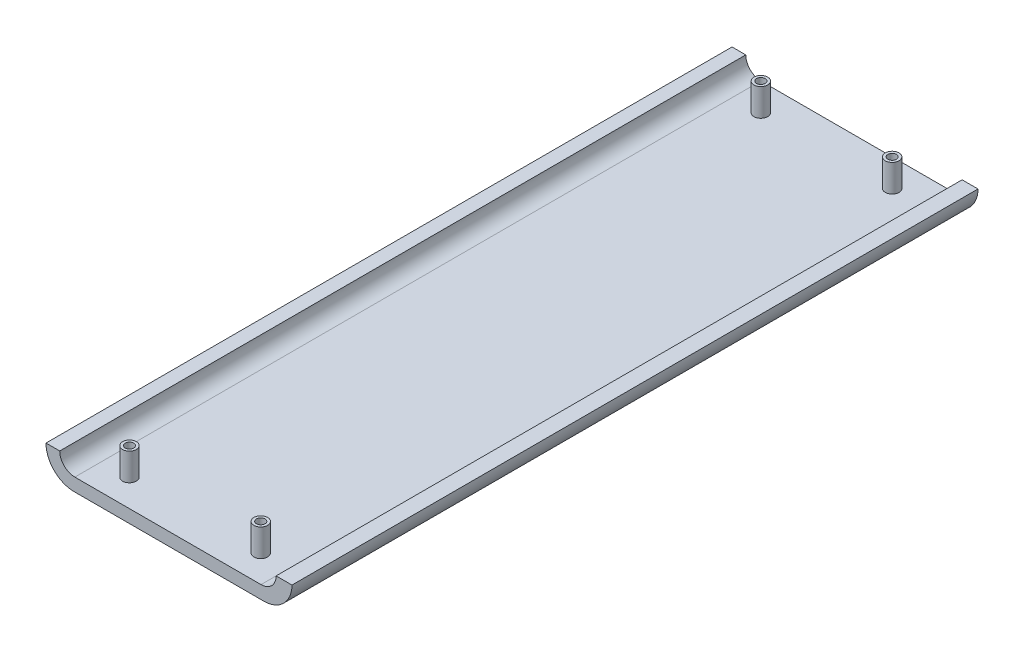
ISO-10303-21;
HEADER;
FILE_DESCRIPTION(('STEP AP214'),'2;1');
FILE_NAME('part.step','',(''),(''),'','','');
FILE_SCHEMA(('AUTOMOTIVE_DESIGN { 1 0 10303 214 1 1 1 1 }'));
ENDSEC;
DATA;
#1=APPLICATION_CONTEXT('core data for automotive mechanical design processes');
#2=APPLICATION_PROTOCOL_DEFINITION('international standard','automotive_design',2000,#1);
#3=PRODUCT_CONTEXT('',#1,'mechanical');
#4=PRODUCT('Part','Part','',(#3));
#5=PRODUCT_RELATED_PRODUCT_CATEGORY('part','',(#4));
#6=PRODUCT_DEFINITION_FORMATION('','',#4);
#7=PRODUCT_DEFINITION_CONTEXT('part definition',#1,'design');
#8=PRODUCT_DEFINITION('design','',#6,#7);
#9=PRODUCT_DEFINITION_SHAPE('','',#8);
#10=(LENGTH_UNIT() NAMED_UNIT(*) SI_UNIT(.MILLI.,.METRE.));
#11=(NAMED_UNIT(*) PLANE_ANGLE_UNIT() SI_UNIT($,.RADIAN.));
#12=(NAMED_UNIT(*) SI_UNIT($,.STERADIAN.) SOLID_ANGLE_UNIT());
#13=UNCERTAINTY_MEASURE_WITH_UNIT(LENGTH_MEASURE(1.E-05),#10,'distance_accuracy_value','');
#14=(GEOMETRIC_REPRESENTATION_CONTEXT(3) GLOBAL_UNCERTAINTY_ASSIGNED_CONTEXT((#13)) GLOBAL_UNIT_ASSIGNED_CONTEXT((#10,
#11,#12)) REPRESENTATION_CONTEXT('',''));
#15=CARTESIAN_POINT('',(0.,0.,0.));
#16=DIRECTION('',(0.,0.,1.));
#17=DIRECTION('',(1.,0.,0.));
#18=AXIS2_PLACEMENT_3D('',#15,#16,#17);
#19=CARTESIAN_POINT('',(-33.1310446929488,5.19258967374228,127.));
#20=DIRECTION('',(0.,0.,-1.));
#21=DIRECTION('',(-1.,0.,0.));
#22=AXIS2_PLACEMENT_3D('',#19,#20,#21);
#23=CYLINDRICAL_SURFACE('',#22,5.19258967374228);
#24=CARTESIAN_POINT('',(-33.1310446929488,5.19258967374228,0.));
#25=DIRECTION('',(0.,0.,1.));
#26=DIRECTION('',(-1.,0.,0.));
#27=AXIS2_PLACEMENT_3D('',#24,#25,#26);
#28=CIRCLE('',#27,5.19258967374228);
#29=CARTESIAN_POINT('',(-38.323634366691,5.19258967374228,0.));
#30=VERTEX_POINT('',#29);
#31=CARTESIAN_POINT('',(-33.1310446929488,0.,0.));
#32=VERTEX_POINT('',#31);
#33=EDGE_CURVE('E129',#30,#32,#28,.T.);
#34=ORIENTED_EDGE('',*,*,#33,.T.);
#35=DIRECTION('',(0.,0.,-1.));
#36=VECTOR('',#35,1.);
#37=CARTESIAN_POINT('',(-33.1310446929488,0.,127.));
#38=LINE('',#37,#36);
#39=CARTESIAN_POINT('',(-33.1310446929488,0.,127.));
#40=VERTEX_POINT('',#39);
#41=EDGE_CURVE('E157',#40,#32,#38,.T.);
#42=ORIENTED_EDGE('',*,*,#41,.F.);
#43=CARTESIAN_POINT('',(-33.1310446929488,5.19258967374228,127.));
#44=DIRECTION('',(0.,0.,1.));
#45=DIRECTION('',(-1.,0.,0.));
#46=AXIS2_PLACEMENT_3D('',#43,#44,#45);
#47=CIRCLE('',#46,5.19258967374228);
#48=CARTESIAN_POINT('',(-38.323634366691,5.19258967374228,127.));
#49=VERTEX_POINT('',#48);
#50=EDGE_CURVE('E144',#49,#40,#47,.T.);
#51=ORIENTED_EDGE('',*,*,#50,.F.);
#52=DIRECTION('',(0.,0.,-1.));
#53=VECTOR('',#52,1.);
#54=CARTESIAN_POINT('',(-38.323634366691,5.19258967374228,127.));
#55=LINE('',#54,#53);
#56=EDGE_CURVE('E125',#49,#30,#55,.T.);
#57=ORIENTED_EDGE('',*,*,#56,.T.);
#58=EDGE_LOOP('',(#34,#42,#51,#57));
#59=FACE_BOUND('',#58,.T.);
#60=ADVANCED_FACE('F32',(#59),#23,.T.);
#61=CARTESIAN_POINT('',(-33.1310446929488,0.,127.));
#62=DIRECTION('',(0.,1.,0.));
#63=DIRECTION('',(-1.,0.,0.));
#64=AXIS2_PLACEMENT_3D('',#61,#62,#63);
#65=PLANE('',#64);
#66=CARTESIAN_POINT('',(-27.909634366691,0.,5.08));
#67=DIRECTION('',(0.,1.,0.));
#68=DIRECTION('',(-1.,0.,0.));
#69=AXIS2_PLACEMENT_3D('',#66,#67,#68);
#70=CIRCLE('',#69,0.793749999999999);
#71=CARTESIAN_POINT('',(-28.703384366691,0.,5.08));
#72=VERTEX_POINT('',#71);
#73=EDGE_CURVE('E249',#72,#72,#70,.T.);
#74=ORIENTED_EDGE('',*,*,#73,.T.);
#75=EDGE_LOOP('',(#74));
#76=FACE_BOUND('',#75,.T.);
#77=CARTESIAN_POINT('',(-3.60190841296975,0.,5.08));
#78=DIRECTION('',(0.,1.,0.));
#79=DIRECTION('',(-1.,0.,0.));
#80=AXIS2_PLACEMENT_3D('',#77,#78,#79);
#81=CIRCLE('',#80,0.793749999999999);
#82=CARTESIAN_POINT('',(-4.39565841296974,0.,5.08));
#83=VERTEX_POINT('',#82);
#84=EDGE_CURVE('E243',#83,#83,#81,.T.);
#85=ORIENTED_EDGE('',*,*,#84,.T.);
#86=EDGE_LOOP('',(#85));
#87=FACE_BOUND('',#86,.T.);
#88=CARTESIAN_POINT('',(-27.909634366691,0.,121.964874011792));
#89=DIRECTION('',(0.,1.,0.));
#90=DIRECTION('',(-1.,0.,0.));
#91=AXIS2_PLACEMENT_3D('',#88,#89,#90);
#92=CIRCLE('',#91,0.793749999999999);
#93=CARTESIAN_POINT('',(-28.703384366691,0.,121.964874011792));
#94=VERTEX_POINT('',#93);
#95=EDGE_CURVE('E237',#94,#94,#92,.T.);
#96=ORIENTED_EDGE('',*,*,#95,.T.);
#97=EDGE_LOOP('',(#96));
#98=FACE_BOUND('',#97,.T.);
#99=CARTESIAN_POINT('',(-3.60190841296975,0.,121.964874011792));
#100=DIRECTION('',(0.,1.,0.));
#101=DIRECTION('',(-1.,0.,0.));
#102=AXIS2_PLACEMENT_3D('',#99,#100,#101);
#103=CIRCLE('',#102,0.793749999999999);
#104=CARTESIAN_POINT('',(-4.39565841296974,0.,121.964874011792));
#105=VERTEX_POINT('',#104);
#106=EDGE_CURVE('E231',#105,#105,#103,.T.);
#107=ORIENTED_EDGE('',*,*,#106,.T.);
#108=EDGE_LOOP('',(#107));
#109=FACE_BOUND('',#108,.T.);
#110=DIRECTION('',(1.,0.,0.));
#111=VECTOR('',#110,1.);
#112=CARTESIAN_POINT('',(-33.1310446929488,0.,0.));
#113=LINE('',#112,#111);
#114=CARTESIAN_POINT('',(2.01705864368437,0.,0.));
#115=VERTEX_POINT('',#114);
#116=EDGE_CURVE('E132',#32,#115,#113,.T.);
#117=ORIENTED_EDGE('',*,*,#116,.T.);
#118=DIRECTION('',(0.,0.,-1.));
#119=VECTOR('',#118,1.);
#120=CARTESIAN_POINT('',(2.01705864368437,0.,127.));
#121=LINE('',#120,#119);
#122=CARTESIAN_POINT('',(2.01705864368437,0.,127.));
#123=VERTEX_POINT('',#122);
#124=EDGE_CURVE('E154',#123,#115,#121,.T.);
#125=ORIENTED_EDGE('',*,*,#124,.F.);
#126=DIRECTION('',(1.,0.,0.));
#127=VECTOR('',#126,1.);
#128=CARTESIAN_POINT('',(-33.1310446929488,0.,127.));
#129=LINE('',#128,#127);
#130=EDGE_CURVE('E92',#40,#123,#129,.T.);
#131=ORIENTED_EDGE('',*,*,#130,.F.);
#132=ORIENTED_EDGE('',*,*,#41,.T.);
#133=EDGE_LOOP('',(#117,#125,#131,#132));
#134=FACE_BOUND('',#133,.T.);
#135=ADVANCED_FACE('F196',(#76,#87,#98,#109,#134),#65,.F.);
#136=CARTESIAN_POINT('',(2.01705864368437,5.19258967374227,127.));
#137=DIRECTION('',(0.,0.,-1.));
#138=DIRECTION('',(-1.,0.,0.));
#139=AXIS2_PLACEMENT_3D('',#136,#137,#138);
#140=CYLINDRICAL_SURFACE('',#139,5.19258967374227);
#141=CARTESIAN_POINT('',(2.01705864368437,5.19258967374227,0.));
#142=DIRECTION('',(0.,0.,1.));
#143=DIRECTION('',(1.,0.,0.));
#144=AXIS2_PLACEMENT_3D('',#141,#142,#143);
#145=CIRCLE('',#144,5.19258967374227);
#146=CARTESIAN_POINT('',(7.20964831742665,5.19258967374227,0.));
#147=VERTEX_POINT('',#146);
#148=EDGE_CURVE('E135',#115,#147,#145,.T.);
#149=ORIENTED_EDGE('',*,*,#148,.T.);
#150=DIRECTION('',(0.,0.,-1.));
#151=VECTOR('',#150,1.);
#152=CARTESIAN_POINT('',(7.20964831742665,5.19258967374227,127.));
#153=LINE('',#152,#151);
#154=CARTESIAN_POINT('',(7.20964831742665,5.19258967374227,127.));
#155=VERTEX_POINT('',#154);
#156=EDGE_CURVE('E151',#155,#147,#153,.T.);
#157=ORIENTED_EDGE('',*,*,#156,.F.);
#158=CARTESIAN_POINT('',(2.01705864368437,5.19258967374227,127.));
#159=DIRECTION('',(0.,0.,1.));
#160=DIRECTION('',(1.,0.,0.));
#161=AXIS2_PLACEMENT_3D('',#158,#159,#160);
#162=CIRCLE('',#161,5.19258967374227);
#163=EDGE_CURVE('E212',#123,#155,#162,.T.);
#164=ORIENTED_EDGE('',*,*,#163,.F.);
#165=ORIENTED_EDGE('',*,*,#124,.T.);
#166=EDGE_LOOP('',(#149,#157,#164,#165));
#167=FACE_BOUND('',#166,.T.);
#168=ADVANCED_FACE('F202',(#167),#140,.T.);
#169=CARTESIAN_POINT('',(7.20964831742665,5.19258967374228,127.));
#170=DIRECTION('',(0.,-1.,0.));
#171=DIRECTION('',(1.,0.,0.));
#172=AXIS2_PLACEMENT_3D('',#169,#170,#171);
#173=PLANE('',#172);
#174=DIRECTION('',(-1.,0.,0.));
#175=VECTOR('',#174,1.);
#176=CARTESIAN_POINT('',(7.20964831742665,5.19258967374228,0.));
#177=LINE('',#176,#175);
#178=CARTESIAN_POINT('',(4.27209158703026,5.19258967374227,0.));
#179=VERTEX_POINT('',#178);
#180=EDGE_CURVE('E137',#147,#179,#177,.T.);
#181=ORIENTED_EDGE('',*,*,#180,.T.);
#182=DIRECTION('',(0.,0.,-1.));
#183=VECTOR('',#182,1.);
#184=CARTESIAN_POINT('',(4.27209158703026,5.19258967374227,127.));
#185=LINE('',#184,#183);
#186=CARTESIAN_POINT('',(4.27209158703026,5.19258967374227,127.));
#187=VERTEX_POINT('',#186);
#188=EDGE_CURVE('E148',#187,#179,#185,.T.);
#189=ORIENTED_EDGE('',*,*,#188,.F.);
#190=DIRECTION('',(-1.,0.,0.));
#191=VECTOR('',#190,1.);
#192=CARTESIAN_POINT('',(7.20964831742665,5.19258967374228,127.));
#193=LINE('',#192,#191);
#194=EDGE_CURVE('E214',#155,#187,#193,.T.);
#195=ORIENTED_EDGE('',*,*,#194,.F.);
#196=ORIENTED_EDGE('',*,*,#156,.T.);
#197=EDGE_LOOP('',(#181,#189,#195,#196));
#198=FACE_BOUND('',#197,.T.);
#199=ADVANCED_FACE('F406',(#198),#173,.F.);
#200=CARTESIAN_POINT('',(1.47809158703026,5.19258967374227,127.));
#201=DIRECTION('',(0.,0.,-1.));
#202=DIRECTION('',(-1.,0.,0.));
#203=AXIS2_PLACEMENT_3D('',#200,#201,#202);
#204=CYLINDRICAL_SURFACE('',#203,2.794);
#205=CARTESIAN_POINT('',(1.47809158703026,5.19258967374227,0.));
#206=DIRECTION('',(0.,0.,-1.));
#207=DIRECTION('',(-1.,0.,0.));
#208=AXIS2_PLACEMENT_3D('',#205,#206,#207);
#209=CIRCLE('',#208,2.794);
#210=CARTESIAN_POINT('',(1.47809158703025,2.39858967374228,0.));
#211=VERTEX_POINT('',#210);
#212=EDGE_CURVE('E139',#179,#211,#209,.T.);
#213=ORIENTED_EDGE('',*,*,#212,.T.);
#214=DIRECTION('',(0.,0.,-1.));
#215=VECTOR('',#214,1.);
#216=CARTESIAN_POINT('',(1.47809158703025,2.39858967374228,127.));
#217=LINE('',#216,#215);
#218=CARTESIAN_POINT('',(1.47809158703025,2.39858967374228,127.));
#219=VERTEX_POINT('',#218);
#220=EDGE_CURVE('E120',#219,#211,#217,.T.);
#221=ORIENTED_EDGE('',*,*,#220,.F.);
#222=CARTESIAN_POINT('',(1.47809158703026,5.19258967374227,127.));
#223=DIRECTION('',(0.,0.,-1.));
#224=DIRECTION('',(-1.,0.,0.));
#225=AXIS2_PLACEMENT_3D('',#222,#223,#224);
#226=CIRCLE('',#225,2.794);
#227=EDGE_CURVE('E111',#187,#219,#226,.T.);
#228=ORIENTED_EDGE('',*,*,#227,.F.);
#229=ORIENTED_EDGE('',*,*,#188,.T.);
#230=EDGE_LOOP('',(#213,#221,#228,#229));
#231=FACE_BOUND('',#230,.T.);
#232=ADVANCED_FACE('F171',(#231),#204,.F.);
#233=CARTESIAN_POINT('',(1.47809158703025,2.39858967374228,127.));
#234=DIRECTION('',(0.,-1.,0.));
#235=DIRECTION('',(1.,0.,0.));
#236=AXIS2_PLACEMENT_3D('',#233,#234,#235);
#237=PLANE('',#236);
#238=CARTESIAN_POINT('',(-3.60190841296975,2.39858967374227,121.964874011792));
#239=DIRECTION('',(0.,-1.,0.));
#240=DIRECTION('',(1.,0.,0.));
#241=AXIS2_PLACEMENT_3D('',#238,#239,#240);
#242=CIRCLE('',#241,1.27);
#243=CARTESIAN_POINT('',(-2.33190841296974,2.39858967374227,121.964874011792));
#244=VERTEX_POINT('',#243);
#245=EDGE_CURVE('E11',#244,#244,#242,.F.);
#246=ORIENTED_EDGE('',*,*,#245,.F.);
#247=EDGE_LOOP('',(#246));
#248=FACE_BOUND('',#247,.T.);
#249=CARTESIAN_POINT('',(-27.909634366691,2.39858967374227,121.964874011792));
#250=DIRECTION('',(0.,-1.,0.));
#251=DIRECTION('',(1.,0.,0.));
#252=AXIS2_PLACEMENT_3D('',#249,#250,#251);
#253=CIRCLE('',#252,1.27);
#254=CARTESIAN_POINT('',(-26.639634366691,2.39858967374227,121.964874011792));
#255=VERTEX_POINT('',#254);
#256=EDGE_CURVE('E40',#255,#255,#253,.F.);
#257=ORIENTED_EDGE('',*,*,#256,.F.);
#258=EDGE_LOOP('',(#257));
#259=FACE_BOUND('',#258,.T.);
#260=CARTESIAN_POINT('',(-3.60190841296975,2.39858967374227,5.08));
#261=DIRECTION('',(0.,-1.,0.));
#262=DIRECTION('',(1.,0.,0.));
#263=AXIS2_PLACEMENT_3D('',#260,#261,#262);
#264=CIRCLE('',#263,1.27);
#265=CARTESIAN_POINT('',(-2.33190841296975,2.39858967374227,5.08));
#266=VERTEX_POINT('',#265);
#267=EDGE_CURVE('E162',#266,#266,#264,.F.);
#268=ORIENTED_EDGE('',*,*,#267,.F.);
#269=EDGE_LOOP('',(#268));
#270=FACE_BOUND('',#269,.T.);
#271=CARTESIAN_POINT('',(-27.909634366691,2.39858967374227,5.08));
#272=DIRECTION('',(0.,-1.,0.));
#273=DIRECTION('',(1.,0.,0.));
#274=AXIS2_PLACEMENT_3D('',#271,#272,#273);
#275=CIRCLE('',#274,1.27);
#276=CARTESIAN_POINT('',(-26.639634366691,2.39858967374227,5.08));
#277=VERTEX_POINT('',#276);
#278=EDGE_CURVE('E159',#277,#277,#275,.F.);
#279=ORIENTED_EDGE('',*,*,#278,.F.);
#280=EDGE_LOOP('',(#279));
#281=FACE_BOUND('',#280,.T.);
#282=DIRECTION('',(-1.,0.,0.));
#283=VECTOR('',#282,1.);
#284=CARTESIAN_POINT('',(1.47809158703025,2.39858967374228,0.));
#285=LINE('',#284,#283);
#286=CARTESIAN_POINT('',(-32.989634366691,2.39858967374227,0.));
#287=VERTEX_POINT('',#286);
#288=EDGE_CURVE('E119',#211,#287,#285,.T.);
#289=ORIENTED_EDGE('',*,*,#288,.T.);
#290=DIRECTION('',(0.,0.,-1.));
#291=VECTOR('',#290,1.);
#292=CARTESIAN_POINT('',(-32.989634366691,2.39858967374227,127.));
#293=LINE('',#292,#291);
#294=CARTESIAN_POINT('',(-32.989634366691,2.39858967374227,127.));
#295=VERTEX_POINT('',#294);
#296=EDGE_CURVE('E116',#295,#287,#293,.T.);
#297=ORIENTED_EDGE('',*,*,#296,.F.);
#298=DIRECTION('',(-1.,0.,0.));
#299=VECTOR('',#298,1.);
#300=CARTESIAN_POINT('',(1.47809158703025,2.39858967374228,127.));
#301=LINE('',#300,#299);
#302=EDGE_CURVE('E105',#219,#295,#301,.T.);
#303=ORIENTED_EDGE('',*,*,#302,.F.);
#304=ORIENTED_EDGE('',*,*,#220,.T.);
#305=EDGE_LOOP('',(#289,#297,#303,#304));
#306=FACE_BOUND('',#305,.T.);
#307=ADVANCED_FACE('F117',(#248,#259,#270,#281,#306),#237,.F.);
#308=CARTESIAN_POINT('',(-32.989634366691,5.19258967374227,127.));
#309=DIRECTION('',(0.,0.,-1.));
#310=DIRECTION('',(-1.,0.,0.));
#311=AXIS2_PLACEMENT_3D('',#308,#309,#310);
#312=CYLINDRICAL_SURFACE('',#311,2.794);
#313=CARTESIAN_POINT('',(-32.989634366691,5.19258967374227,0.));
#314=DIRECTION('',(0.,0.,-1.));
#315=DIRECTION('',(-1.,0.,0.));
#316=AXIS2_PLACEMENT_3D('',#313,#314,#315);
#317=CIRCLE('',#316,2.794);
#318=CARTESIAN_POINT('',(-35.783634366691,5.19258967374227,0.));
#319=VERTEX_POINT('',#318);
#320=EDGE_CURVE('E77',#287,#319,#317,.T.);
#321=ORIENTED_EDGE('',*,*,#320,.T.);
#322=DIRECTION('',(0.,0.,-1.));
#323=VECTOR('',#322,1.);
#324=CARTESIAN_POINT('',(-35.783634366691,5.19258967374227,127.));
#325=LINE('',#324,#323);
#326=CARTESIAN_POINT('',(-35.783634366691,5.19258967374227,127.));
#327=VERTEX_POINT('',#326);
#328=EDGE_CURVE('E121',#327,#319,#325,.T.);
#329=ORIENTED_EDGE('',*,*,#328,.F.);
#330=CARTESIAN_POINT('',(-32.989634366691,5.19258967374227,127.));
#331=DIRECTION('',(0.,0.,-1.));
#332=DIRECTION('',(-1.,0.,0.));
#333=AXIS2_PLACEMENT_3D('',#330,#331,#332);
#334=CIRCLE('',#333,2.794);
#335=EDGE_CURVE('E109',#295,#327,#334,.T.);
#336=ORIENTED_EDGE('',*,*,#335,.F.);
#337=ORIENTED_EDGE('',*,*,#296,.T.);
#338=EDGE_LOOP('',(#321,#329,#336,#337));
#339=FACE_BOUND('',#338,.T.);
#340=ADVANCED_FACE('F123',(#339),#312,.F.);
#341=CARTESIAN_POINT('',(-38.323634366691,5.19258967374228,127.));
#342=DIRECTION('',(0.,-1.,0.));
#343=DIRECTION('',(1.,0.,0.));
#344=AXIS2_PLACEMENT_3D('',#341,#342,#343);
#345=PLANE('',#344);
#346=DIRECTION('',(-1.,0.,0.));
#347=VECTOR('',#346,1.);
#348=CARTESIAN_POINT('',(-38.323634366691,5.19258967374228,0.));
#349=LINE('',#348,#347);
#350=EDGE_CURVE('E83',#319,#30,#349,.T.);
#351=ORIENTED_EDGE('',*,*,#350,.T.);
#352=ORIENTED_EDGE('',*,*,#56,.F.);
#353=DIRECTION('',(-1.,0.,0.));
#354=VECTOR('',#353,1.);
#355=CARTESIAN_POINT('',(-38.323634366691,5.19258967374228,127.));
#356=LINE('',#355,#354);
#357=EDGE_CURVE('E48',#327,#49,#356,.T.);
#358=ORIENTED_EDGE('',*,*,#357,.F.);
#359=ORIENTED_EDGE('',*,*,#328,.T.);
#360=EDGE_LOOP('',(#351,#352,#358,#359));
#361=FACE_BOUND('',#360,.T.);
#362=ADVANCED_FACE('F380',(#361),#345,.F.);
#363=CARTESIAN_POINT('',(-33.1310446929488,5.19258967374228,127.));
#364=DIRECTION('',(0.,0.,-1.));
#365=DIRECTION('',(-1.,0.,0.));
#366=AXIS2_PLACEMENT_3D('',#363,#364,#365);
#367=PLANE('',#366);
#368=ORIENTED_EDGE('',*,*,#50,.T.);
#369=ORIENTED_EDGE('',*,*,#130,.T.);
#370=ORIENTED_EDGE('',*,*,#163,.T.);
#371=ORIENTED_EDGE('',*,*,#194,.T.);
#372=ORIENTED_EDGE('',*,*,#227,.T.);
#373=ORIENTED_EDGE('',*,*,#302,.T.);
#374=ORIENTED_EDGE('',*,*,#335,.T.);
#375=ORIENTED_EDGE('',*,*,#357,.T.);
#376=EDGE_LOOP('',(#368,#369,#370,#371,#372,#373,#374,#375));
#377=FACE_BOUND('',#376,.T.);
#378=ADVANCED_FACE('F107',(#377),#367,.F.);
#379=CARTESIAN_POINT('',(-33.1310446929488,5.19258967374228,0.));
#380=DIRECTION('',(0.,0.,-1.));
#381=DIRECTION('',(-1.,0.,0.));
#382=AXIS2_PLACEMENT_3D('',#379,#380,#381);
#383=PLANE('',#382);
#384=ORIENTED_EDGE('',*,*,#33,.F.);
#385=ORIENTED_EDGE('',*,*,#350,.F.);
#386=ORIENTED_EDGE('',*,*,#320,.F.);
#387=ORIENTED_EDGE('',*,*,#288,.F.);
#388=ORIENTED_EDGE('',*,*,#212,.F.);
#389=ORIENTED_EDGE('',*,*,#180,.F.);
#390=ORIENTED_EDGE('',*,*,#148,.F.);
#391=ORIENTED_EDGE('',*,*,#116,.F.);
#392=EDGE_LOOP('',(#384,#385,#386,#387,#388,#389,#390,#391));
#393=FACE_BOUND('',#392,.T.);
#394=ADVANCED_FACE('F181',(#393),#383,.T.);
#395=CARTESIAN_POINT('',(-27.909634366691,7.47858967374227,5.08));
#396=DIRECTION('',(0.,-1.,0.));
#397=DIRECTION('',(1.,0.,0.));
#398=AXIS2_PLACEMENT_3D('',#395,#396,#397);
#399=CYLINDRICAL_SURFACE('',#398,1.27);
#400=CARTESIAN_POINT('',(-27.909634366691,7.47858967374227,5.08));
#401=DIRECTION('',(0.,1.,0.));
#402=DIRECTION('',(-1.,0.,0.));
#403=AXIS2_PLACEMENT_3D('',#400,#401,#402);
#404=CIRCLE('',#403,1.27);
#405=CARTESIAN_POINT('',(-29.179634366691,7.47858967374227,5.08));
#406=VERTEX_POINT('',#405);
#407=EDGE_CURVE('E133',#406,#406,#404,.T.);
#408=ORIENTED_EDGE('',*,*,#407,.F.);
#409=EDGE_LOOP('',(#408));
#410=FACE_BOUND('',#409,.T.);
#411=ORIENTED_EDGE('',*,*,#278,.T.);
#412=EDGE_LOOP('',(#411));
#413=FACE_BOUND('',#412,.T.);
#414=ADVANCED_FACE('F178',(#410,#413),#399,.T.);
#415=CARTESIAN_POINT('',(-27.909634366691,7.47858967374227,5.08));
#416=DIRECTION('',(0.,1.,0.));
#417=DIRECTION('',(-1.,0.,0.));
#418=AXIS2_PLACEMENT_3D('',#415,#416,#417);
#419=PLANE('',#418);
#420=CARTESIAN_POINT('',(-27.909634366691,7.47858967374227,5.08));
#421=DIRECTION('',(0.,1.,0.));
#422=DIRECTION('',(0.,0.,1.));
#423=AXIS2_PLACEMENT_3D('',#420,#421,#422);
#424=CIRCLE('',#423,0.793749999999999);
#425=CARTESIAN_POINT('',(-27.909634366691,7.47858967374227,5.87375));
#426=VERTEX_POINT('',#425);
#427=EDGE_CURVE('E252',#426,#426,#424,.T.);
#428=ORIENTED_EDGE('',*,*,#427,.F.);
#429=EDGE_LOOP('',(#428));
#430=FACE_BOUND('',#429,.T.);
#431=ORIENTED_EDGE('',*,*,#407,.T.);
#432=EDGE_LOOP('',(#431));
#433=FACE_BOUND('',#432,.T.);
#434=ADVANCED_FACE('F180',(#430,#433),#419,.T.);
#435=CARTESIAN_POINT('',(-3.60190841296975,7.47858967374227,5.08));
#436=DIRECTION('',(0.,-1.,0.));
#437=DIRECTION('',(1.,0.,0.));
#438=AXIS2_PLACEMENT_3D('',#435,#436,#437);
#439=CYLINDRICAL_SURFACE('',#438,1.27);
#440=CARTESIAN_POINT('',(-3.60190841296975,7.47858967374227,5.08));
#441=DIRECTION('',(0.,1.,0.));
#442=DIRECTION('',(-1.,0.,0.));
#443=AXIS2_PLACEMENT_3D('',#440,#441,#442);
#444=CIRCLE('',#443,1.27);
#445=CARTESIAN_POINT('',(-4.87190841296975,7.47858967374227,5.08));
#446=VERTEX_POINT('',#445);
#447=EDGE_CURVE('E222',#446,#446,#444,.T.);
#448=ORIENTED_EDGE('',*,*,#447,.F.);
#449=EDGE_LOOP('',(#448));
#450=FACE_BOUND('',#449,.T.);
#451=ORIENTED_EDGE('',*,*,#267,.T.);
#452=EDGE_LOOP('',(#451));
#453=FACE_BOUND('',#452,.T.);
#454=ADVANCED_FACE('F188',(#450,#453),#439,.T.);
#455=CARTESIAN_POINT('',(-3.60190841296975,7.47858967374227,5.08));
#456=DIRECTION('',(0.,1.,0.));
#457=DIRECTION('',(-1.,0.,0.));
#458=AXIS2_PLACEMENT_3D('',#455,#456,#457);
#459=PLANE('',#458);
#460=CARTESIAN_POINT('',(-3.60190841296975,7.47858967374227,5.08));
#461=DIRECTION('',(0.,1.,0.));
#462=DIRECTION('',(0.,0.,1.));
#463=AXIS2_PLACEMENT_3D('',#460,#461,#462);
#464=CIRCLE('',#463,0.793749999999999);
#465=CARTESIAN_POINT('',(-3.60190841296975,7.47858967374227,5.87375));
#466=VERTEX_POINT('',#465);
#467=EDGE_CURVE('E246',#466,#466,#464,.T.);
#468=ORIENTED_EDGE('',*,*,#467,.F.);
#469=EDGE_LOOP('',(#468));
#470=FACE_BOUND('',#469,.T.);
#471=ORIENTED_EDGE('',*,*,#447,.T.);
#472=EDGE_LOOP('',(#471));
#473=FACE_BOUND('',#472,.T.);
#474=ADVANCED_FACE('F291',(#470,#473),#459,.T.);
#475=CARTESIAN_POINT('',(-27.909634366691,7.47858967374227,121.964874011792));
#476=DIRECTION('',(0.,-1.,0.));
#477=DIRECTION('',(1.,0.,0.));
#478=AXIS2_PLACEMENT_3D('',#475,#476,#477);
#479=CYLINDRICAL_SURFACE('',#478,1.27);
#480=CARTESIAN_POINT('',(-27.909634366691,7.47858967374227,121.964874011792));
#481=DIRECTION('',(0.,1.,0.));
#482=DIRECTION('',(-1.,0.,0.));
#483=AXIS2_PLACEMENT_3D('',#480,#481,#482);
#484=CIRCLE('',#483,1.27);
#485=CARTESIAN_POINT('',(-29.179634366691,7.47858967374227,121.964874011792));
#486=VERTEX_POINT('',#485);
#487=EDGE_CURVE('E225',#486,#486,#484,.T.);
#488=ORIENTED_EDGE('',*,*,#487,.F.);
#489=EDGE_LOOP('',(#488));
#490=FACE_BOUND('',#489,.T.);
#491=ORIENTED_EDGE('',*,*,#256,.T.);
#492=EDGE_LOOP('',(#491));
#493=FACE_BOUND('',#492,.T.);
#494=ADVANCED_FACE('F167',(#490,#493),#479,.T.);
#495=CARTESIAN_POINT('',(-27.909634366691,7.47858967374227,121.964874011792));
#496=DIRECTION('',(0.,1.,0.));
#497=DIRECTION('',(-1.,0.,0.));
#498=AXIS2_PLACEMENT_3D('',#495,#496,#497);
#499=PLANE('',#498);
#500=CARTESIAN_POINT('',(-27.909634366691,7.47858967374227,121.964874011792));
#501=DIRECTION('',(0.,1.,0.));
#502=DIRECTION('',(0.,0.,1.));
#503=AXIS2_PLACEMENT_3D('',#500,#501,#502);
#504=CIRCLE('',#503,0.793749999999999);
#505=CARTESIAN_POINT('',(-27.909634366691,7.47858967374227,122.758624011792));
#506=VERTEX_POINT('',#505);
#507=EDGE_CURVE('E240',#506,#506,#504,.T.);
#508=ORIENTED_EDGE('',*,*,#507,.F.);
#509=EDGE_LOOP('',(#508));
#510=FACE_BOUND('',#509,.T.);
#511=ORIENTED_EDGE('',*,*,#487,.T.);
#512=EDGE_LOOP('',(#511));
#513=FACE_BOUND('',#512,.T.);
#514=ADVANCED_FACE('F284',(#510,#513),#499,.T.);
#515=CARTESIAN_POINT('',(-3.60190841296975,7.47858967374227,121.964874011792));
#516=DIRECTION('',(0.,-1.,0.));
#517=DIRECTION('',(1.,0.,0.));
#518=AXIS2_PLACEMENT_3D('',#515,#516,#517);
#519=CYLINDRICAL_SURFACE('',#518,1.27);
#520=CARTESIAN_POINT('',(-3.60190841296975,7.47858967374227,121.964874011792));
#521=DIRECTION('',(0.,1.,0.));
#522=DIRECTION('',(-1.,0.,0.));
#523=AXIS2_PLACEMENT_3D('',#520,#521,#522);
#524=CIRCLE('',#523,1.27);
#525=CARTESIAN_POINT('',(-4.87190841296975,7.47858967374227,121.964874011792));
#526=VERTEX_POINT('',#525);
#527=EDGE_CURVE('E228',#526,#526,#524,.T.);
#528=ORIENTED_EDGE('',*,*,#527,.F.);
#529=EDGE_LOOP('',(#528));
#530=FACE_BOUND('',#529,.T.);
#531=ORIENTED_EDGE('',*,*,#245,.T.);
#532=EDGE_LOOP('',(#531));
#533=FACE_BOUND('',#532,.T.);
#534=ADVANCED_FACE('F280',(#530,#533),#519,.T.);
#535=CARTESIAN_POINT('',(-3.60190841296975,7.47858967374227,121.964874011792));
#536=DIRECTION('',(0.,1.,0.));
#537=DIRECTION('',(-1.,0.,0.));
#538=AXIS2_PLACEMENT_3D('',#535,#536,#537);
#539=PLANE('',#538);
#540=CARTESIAN_POINT('',(-3.60190841296975,7.47858967374227,121.964874011792));
#541=DIRECTION('',(0.,1.,0.));
#542=DIRECTION('',(0.,0.,1.));
#543=AXIS2_PLACEMENT_3D('',#540,#541,#542);
#544=CIRCLE('',#543,0.793749999999999);
#545=CARTESIAN_POINT('',(-3.60190841296975,7.47858967374227,122.758624011792));
#546=VERTEX_POINT('',#545);
#547=EDGE_CURVE('E234',#546,#546,#544,.T.);
#548=ORIENTED_EDGE('',*,*,#547,.F.);
#549=EDGE_LOOP('',(#548));
#550=FACE_BOUND('',#549,.T.);
#551=ORIENTED_EDGE('',*,*,#527,.T.);
#552=EDGE_LOOP('',(#551));
#553=FACE_BOUND('',#552,.T.);
#554=ADVANCED_FACE('F276',(#550,#553),#539,.T.);
#555=CARTESIAN_POINT('',(-3.60190841296975,7.47858967374227,121.964874011792));
#556=DIRECTION('',(0.,1.,0.));
#557=DIRECTION('',(0.,0.,1.));
#558=AXIS2_PLACEMENT_3D('',#555,#556,#557);
#559=CYLINDRICAL_SURFACE('',#558,0.793749999999999);
#560=ORIENTED_EDGE('',*,*,#106,.F.);
#561=EDGE_LOOP('',(#560));
#562=FACE_BOUND('',#561,.T.);
#563=ORIENTED_EDGE('',*,*,#547,.T.);
#564=EDGE_LOOP('',(#563));
#565=FACE_BOUND('',#564,.T.);
#566=ADVANCED_FACE('F272',(#562,#565),#559,.F.);
#567=CARTESIAN_POINT('',(-27.909634366691,7.47858967374227,121.964874011792));
#568=DIRECTION('',(0.,1.,0.));
#569=DIRECTION('',(0.,0.,1.));
#570=AXIS2_PLACEMENT_3D('',#567,#568,#569);
#571=CYLINDRICAL_SURFACE('',#570,0.793749999999999);
#572=ORIENTED_EDGE('',*,*,#95,.F.);
#573=EDGE_LOOP('',(#572));
#574=FACE_BOUND('',#573,.T.);
#575=ORIENTED_EDGE('',*,*,#507,.T.);
#576=EDGE_LOOP('',(#575));
#577=FACE_BOUND('',#576,.T.);
#578=ADVANCED_FACE('F265',(#574,#577),#571,.F.);
#579=CARTESIAN_POINT('',(-3.60190841296975,7.47858967374227,5.08));
#580=DIRECTION('',(0.,1.,0.));
#581=DIRECTION('',(0.,0.,1.));
#582=AXIS2_PLACEMENT_3D('',#579,#580,#581);
#583=CYLINDRICAL_SURFACE('',#582,0.793749999999999);
#584=ORIENTED_EDGE('',*,*,#84,.F.);
#585=EDGE_LOOP('',(#584));
#586=FACE_BOUND('',#585,.T.);
#587=ORIENTED_EDGE('',*,*,#467,.T.);
#588=EDGE_LOOP('',(#587));
#589=FACE_BOUND('',#588,.T.);
#590=ADVANCED_FACE('F259',(#586,#589),#583,.F.);
#591=CARTESIAN_POINT('',(-27.909634366691,7.47858967374227,5.08));
#592=DIRECTION('',(0.,1.,0.));
#593=DIRECTION('',(0.,0.,1.));
#594=AXIS2_PLACEMENT_3D('',#591,#592,#593);
#595=CYLINDRICAL_SURFACE('',#594,0.793749999999999);
#596=ORIENTED_EDGE('',*,*,#73,.F.);
#597=EDGE_LOOP('',(#596));
#598=FACE_BOUND('',#597,.T.);
#599=ORIENTED_EDGE('',*,*,#427,.T.);
#600=EDGE_LOOP('',(#599));
#601=FACE_BOUND('',#600,.T.);
#602=ADVANCED_FACE('F256',(#598,#601),#595,.F.);
#603=CLOSED_SHELL('',(#60,#135,#168,#199,#232,#307,#340,#362,#378,#394,#414,#434,#454,#474,#494,
#514,#534,#554,#566,#578,#590,#602));
#604=MANIFOLD_SOLID_BREP('B2',#603);
#605=ADVANCED_BREP_SHAPE_REPRESENTATION('',(#18,#604),#14);
#606=SHAPE_DEFINITION_REPRESENTATION(#9,#605);
ENDSEC;
END-ISO-10303-21;
